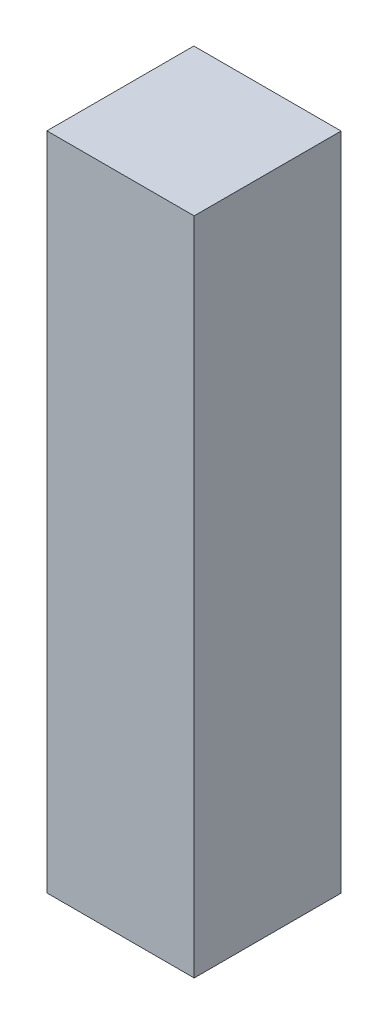
ISO-10303-21;
HEADER;
FILE_DESCRIPTION(('STEP AP214'),'2;1');
FILE_NAME('part.step','',(''),(''),'','','');
FILE_SCHEMA(('AUTOMOTIVE_DESIGN { 1 0 10303 214 1 1 1 1 }'));
ENDSEC;
DATA;
#1=APPLICATION_CONTEXT('core data for automotive mechanical design processes');
#2=APPLICATION_PROTOCOL_DEFINITION('international standard','automotive_design',2000,#1);
#3=PRODUCT_CONTEXT('',#1,'mechanical');
#4=PRODUCT('Part','Part','',(#3));
#5=PRODUCT_RELATED_PRODUCT_CATEGORY('part','',(#4));
#6=PRODUCT_DEFINITION_FORMATION('','',#4);
#7=PRODUCT_DEFINITION_CONTEXT('part definition',#1,'design');
#8=PRODUCT_DEFINITION('design','',#6,#7);
#9=PRODUCT_DEFINITION_SHAPE('','',#8);
#10=(LENGTH_UNIT() NAMED_UNIT(*) SI_UNIT(.MILLI.,.METRE.));
#11=(NAMED_UNIT(*) PLANE_ANGLE_UNIT() SI_UNIT($,.RADIAN.));
#12=(NAMED_UNIT(*) SI_UNIT($,.STERADIAN.) SOLID_ANGLE_UNIT());
#13=UNCERTAINTY_MEASURE_WITH_UNIT(LENGTH_MEASURE(1.E-05),#10,'distance_accuracy_value','');
#14=(GEOMETRIC_REPRESENTATION_CONTEXT(3) GLOBAL_UNCERTAINTY_ASSIGNED_CONTEXT((#13)) GLOBAL_UNIT_ASSIGNED_CONTEXT((#10,
#11,#12)) REPRESENTATION_CONTEXT('',''));
#15=CARTESIAN_POINT('',(0.,0.,0.));
#16=DIRECTION('',(0.,0.,1.));
#17=DIRECTION('',(1.,0.,0.));
#18=AXIS2_PLACEMENT_3D('',#15,#16,#17);
#19=CARTESIAN_POINT('',(19.1911111111111,-914.4,-17.7372390572391));
#20=DIRECTION('',(-1.,0.,0.));
#21=DIRECTION('',(0.,0.,1.));
#22=AXIS2_PLACEMENT_3D('',#19,#20,#21);
#23=PLANE('',#22);
#24=DIRECTION('',(0.,0.,1.));
#25=VECTOR('',#24,1.);
#26=CARTESIAN_POINT('',(19.1911111111111,0.,-17.7372390572391));
#27=LINE('',#26,#25);
#28=CARTESIAN_POINT('',(19.1911111111111,0.,-17.7372390572391));
#29=VERTEX_POINT('',#28);
#30=CARTESIAN_POINT('',(19.1911111111111,0.,185.810321413255));
#31=VERTEX_POINT('',#30);
#32=EDGE_CURVE('E103',#29,#31,#27,.T.);
#33=ORIENTED_EDGE('',*,*,#32,.F.);
#34=DIRECTION('',(0.,1.,0.));
#35=VECTOR('',#34,1.);
#36=CARTESIAN_POINT('',(19.1911111111111,-914.4,-17.7372390572391));
#37=LINE('',#36,#35);
#38=CARTESIAN_POINT('',(19.1911111111111,-914.4,-17.7372390572391));
#39=VERTEX_POINT('',#38);
#40=EDGE_CURVE('E11',#39,#29,#37,.T.);
#41=ORIENTED_EDGE('',*,*,#40,.F.);
#42=DIRECTION('',(0.,0.,1.));
#43=VECTOR('',#42,1.);
#44=CARTESIAN_POINT('',(19.1911111111111,-914.4,-17.7372390572391));
#45=LINE('',#44,#43);
#46=CARTESIAN_POINT('',(19.1911111111111,-914.4,185.810321413255));
#47=VERTEX_POINT('',#46);
#48=EDGE_CURVE('E97',#39,#47,#45,.T.);
#49=ORIENTED_EDGE('',*,*,#48,.T.);
#50=DIRECTION('',(0.,1.,0.));
#51=VECTOR('',#50,1.);
#52=CARTESIAN_POINT('',(19.1911111111111,-914.4,185.810321413255));
#53=LINE('',#52,#51);
#54=EDGE_CURVE('E42',#47,#31,#53,.T.);
#55=ORIENTED_EDGE('',*,*,#54,.T.);
#56=EDGE_LOOP('',(#33,#41,#49,#55));
#57=FACE_BOUND('',#56,.T.);
#58=ADVANCED_FACE('F39',(#57),#23,.T.);
#59=CARTESIAN_POINT('',(19.1911111111111,-914.4,-17.7372390572391));
#60=DIRECTION('',(0.,0.,-1.));
#61=DIRECTION('',(-1.,0.,0.));
#62=AXIS2_PLACEMENT_3D('',#59,#60,#61);
#63=PLANE('',#62);
#64=DIRECTION('',(-1.,0.,0.));
#65=VECTOR('',#64,1.);
#66=CARTESIAN_POINT('',(19.1911111111111,0.,-17.7372390572391));
#67=LINE('',#66,#65);
#68=CARTESIAN_POINT('',(223.203574594209,0.,-17.7372390572391));
#69=VERTEX_POINT('',#68);
#70=EDGE_CURVE('E99',#69,#29,#67,.T.);
#71=ORIENTED_EDGE('',*,*,#70,.F.);
#72=DIRECTION('',(0.,1.,0.));
#73=VECTOR('',#72,1.);
#74=CARTESIAN_POINT('',(223.203574594209,-914.4,-17.7372390572391));
#75=LINE('',#74,#73);
#76=CARTESIAN_POINT('',(223.203574594209,-914.4,-17.7372390572391));
#77=VERTEX_POINT('',#76);
#78=EDGE_CURVE('E48',#77,#69,#75,.T.);
#79=ORIENTED_EDGE('',*,*,#78,.F.);
#80=DIRECTION('',(-1.,0.,0.));
#81=VECTOR('',#80,1.);
#82=CARTESIAN_POINT('',(19.1911111111111,-914.4,-17.7372390572391));
#83=LINE('',#82,#81);
#84=EDGE_CURVE('E94',#77,#39,#83,.T.);
#85=ORIENTED_EDGE('',*,*,#84,.T.);
#86=ORIENTED_EDGE('',*,*,#40,.T.);
#87=EDGE_LOOP('',(#71,#79,#85,#86));
#88=FACE_BOUND('',#87,.T.);
#89=ADVANCED_FACE('F113',(#88),#63,.T.);
#90=CARTESIAN_POINT('',(223.203574594209,-914.4,-17.7372390572391));
#91=DIRECTION('',(1.,0.,0.));
#92=DIRECTION('',(0.,0.,-1.));
#93=AXIS2_PLACEMENT_3D('',#90,#91,#92);
#94=PLANE('',#93);
#95=DIRECTION('',(0.,0.,-1.));
#96=VECTOR('',#95,1.);
#97=CARTESIAN_POINT('',(223.203574594209,0.,-17.7372390572391));
#98=LINE('',#97,#96);
#99=CARTESIAN_POINT('',(223.203574594209,0.,185.810321413255));
#100=VERTEX_POINT('',#99);
#101=EDGE_CURVE('E89',#100,#69,#98,.T.);
#102=ORIENTED_EDGE('',*,*,#101,.F.);
#103=DIRECTION('',(0.,1.,0.));
#104=VECTOR('',#103,1.);
#105=CARTESIAN_POINT('',(223.203574594209,-914.4,185.810321413255));
#106=LINE('',#105,#104);
#107=CARTESIAN_POINT('',(223.203574594209,-914.4,185.810321413255));
#108=VERTEX_POINT('',#107);
#109=EDGE_CURVE('E84',#108,#100,#106,.T.);
#110=ORIENTED_EDGE('',*,*,#109,.F.);
#111=DIRECTION('',(0.,0.,-1.));
#112=VECTOR('',#111,1.);
#113=CARTESIAN_POINT('',(223.203574594209,-914.4,-17.7372390572391));
#114=LINE('',#113,#112);
#115=EDGE_CURVE('E87',#108,#77,#114,.T.);
#116=ORIENTED_EDGE('',*,*,#115,.T.);
#117=ORIENTED_EDGE('',*,*,#78,.T.);
#118=EDGE_LOOP('',(#102,#110,#116,#117));
#119=FACE_BOUND('',#118,.T.);
#120=ADVANCED_FACE('F86',(#119),#94,.T.);
#121=CARTESIAN_POINT('',(19.1911111111111,-914.4,185.810321413255));
#122=DIRECTION('',(0.,0.,1.));
#123=DIRECTION('',(1.,0.,0.));
#124=AXIS2_PLACEMENT_3D('',#121,#122,#123);
#125=PLANE('',#124);
#126=DIRECTION('',(1.,0.,0.));
#127=VECTOR('',#126,1.);
#128=CARTESIAN_POINT('',(19.1911111111111,0.,185.810321413255));
#129=LINE('',#128,#127);
#130=EDGE_CURVE('E106',#31,#100,#129,.T.);
#131=ORIENTED_EDGE('',*,*,#130,.F.);
#132=ORIENTED_EDGE('',*,*,#54,.F.);
#133=DIRECTION('',(1.,0.,0.));
#134=VECTOR('',#133,1.);
#135=CARTESIAN_POINT('',(19.1911111111111,-914.4,185.810321413255));
#136=LINE('',#135,#134);
#137=EDGE_CURVE('E93',#47,#108,#136,.T.);
#138=ORIENTED_EDGE('',*,*,#137,.T.);
#139=ORIENTED_EDGE('',*,*,#109,.T.);
#140=EDGE_LOOP('',(#131,#132,#138,#139));
#141=FACE_BOUND('',#140,.T.);
#142=ADVANCED_FACE('F96',(#141),#125,.T.);
#143=CARTESIAN_POINT('',(0.,-914.4,0.));
#144=DIRECTION('',(0.,1.,0.));
#145=DIRECTION('',(0.,0.,1.));
#146=AXIS2_PLACEMENT_3D('',#143,#144,#145);
#147=PLANE('',#146);
#148=ORIENTED_EDGE('',*,*,#48,.F.);
#149=ORIENTED_EDGE('',*,*,#84,.F.);
#150=ORIENTED_EDGE('',*,*,#115,.F.);
#151=ORIENTED_EDGE('',*,*,#137,.F.);
#152=EDGE_LOOP('',(#148,#149,#150,#151));
#153=FACE_BOUND('',#152,.T.);
#154=ADVANCED_FACE('F92',(#153),#147,.F.);
#155=CARTESIAN_POINT('',(0.,0.,0.));
#156=DIRECTION('',(0.,1.,0.));
#157=DIRECTION('',(0.,0.,1.));
#158=AXIS2_PLACEMENT_3D('',#155,#156,#157);
#159=PLANE('',#158);
#160=ORIENTED_EDGE('',*,*,#32,.T.);
#161=ORIENTED_EDGE('',*,*,#130,.T.);
#162=ORIENTED_EDGE('',*,*,#101,.T.);
#163=ORIENTED_EDGE('',*,*,#70,.T.);
#164=EDGE_LOOP('',(#160,#161,#162,#163));
#165=FACE_BOUND('',#164,.T.);
#166=ADVANCED_FACE('F112',(#165),#159,.T.);
#167=CLOSED_SHELL('',(#58,#89,#120,#142,#154,#166));
#168=MANIFOLD_SOLID_BREP('B2',#167);
#169=ADVANCED_BREP_SHAPE_REPRESENTATION('',(#18,#168),#14);
#170=SHAPE_DEFINITION_REPRESENTATION(#9,#169);
ENDSEC;
END-ISO-10303-21;
